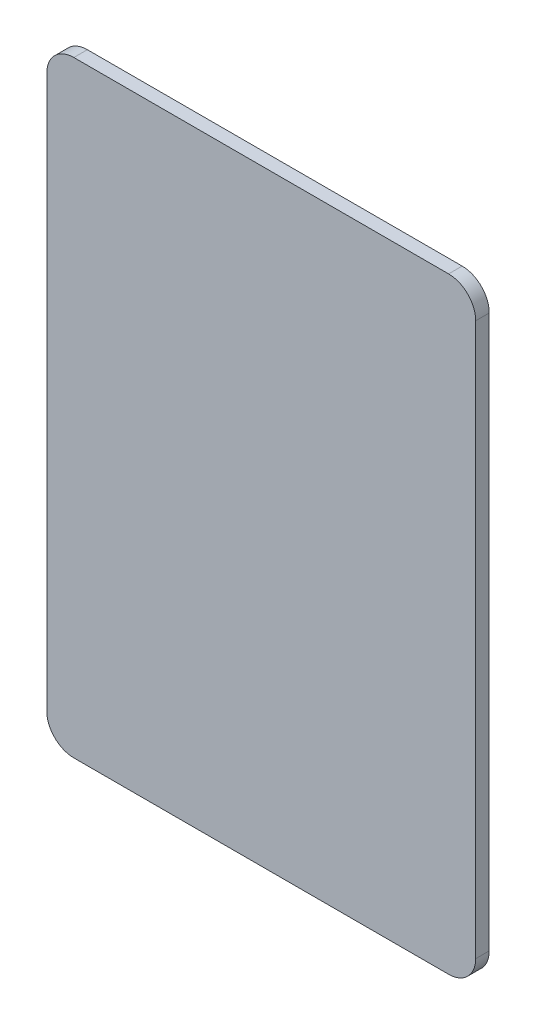
ISO-10303-21;
HEADER;
FILE_DESCRIPTION(('STEP AP214'),'2;1');
FILE_NAME('part.step','',(''),(''),'','','');
FILE_SCHEMA(('AUTOMOTIVE_DESIGN { 1 0 10303 214 1 1 1 1 }'));
ENDSEC;
DATA;
#1=APPLICATION_CONTEXT('core data for automotive mechanical design processes');
#2=APPLICATION_PROTOCOL_DEFINITION('international standard','automotive_design',2000,#1);
#3=PRODUCT_CONTEXT('',#1,'mechanical');
#4=PRODUCT('Part','Part','',(#3));
#5=PRODUCT_RELATED_PRODUCT_CATEGORY('part','',(#4));
#6=PRODUCT_DEFINITION_FORMATION('','',#4);
#7=PRODUCT_DEFINITION_CONTEXT('part definition',#1,'design');
#8=PRODUCT_DEFINITION('design','',#6,#7);
#9=PRODUCT_DEFINITION_SHAPE('','',#8);
#10=(LENGTH_UNIT() NAMED_UNIT(*) SI_UNIT(.MILLI.,.METRE.));
#11=(NAMED_UNIT(*) PLANE_ANGLE_UNIT() SI_UNIT($,.RADIAN.));
#12=(NAMED_UNIT(*) SI_UNIT($,.STERADIAN.) SOLID_ANGLE_UNIT());
#13=UNCERTAINTY_MEASURE_WITH_UNIT(LENGTH_MEASURE(1.E-05),#10,'distance_accuracy_value','');
#14=(GEOMETRIC_REPRESENTATION_CONTEXT(3) GLOBAL_UNCERTAINTY_ASSIGNED_CONTEXT((#13)) GLOBAL_UNIT_ASSIGNED_CONTEXT((#10,
#11,#12)) REPRESENTATION_CONTEXT('',''));
#15=CARTESIAN_POINT('',(0.,0.,0.));
#16=DIRECTION('',(0.,0.,1.));
#17=DIRECTION('',(1.,0.,0.));
#18=AXIS2_PLACEMENT_3D('',#15,#16,#17);
#19=CARTESIAN_POINT('',(0.,0.,1.5875));
#20=DIRECTION('',(1.,0.,0.));
#21=DIRECTION('',(0.,0.,-1.));
#22=AXIS2_PLACEMENT_3D('',#19,#20,#21);
#23=PLANE('',#22);
#24=DIRECTION('',(0.,-1.,0.));
#25=VECTOR('',#24,1.);
#26=CARTESIAN_POINT('',(0.,0.,0.));
#27=LINE('',#26,#25);
#28=CARTESIAN_POINT('',(0.,67.945,0.));
#29=VERTEX_POINT('',#28);
#30=CARTESIAN_POINT('',(0.,3.175,0.));
#31=VERTEX_POINT('',#30);
#32=EDGE_CURVE('E128',#29,#31,#27,.T.);
#33=ORIENTED_EDGE('',*,*,#32,.T.);
#34=DIRECTION('',(0.,0.,-1.));
#35=VECTOR('',#34,1.);
#36=CARTESIAN_POINT('',(0.,3.175,1.5875));
#37=LINE('',#36,#35);
#38=CARTESIAN_POINT('',(0.,3.175,1.5875));
#39=VERTEX_POINT('',#38);
#40=EDGE_CURVE('E151',#31,#39,#37,.F.);
#41=ORIENTED_EDGE('',*,*,#40,.T.);
#42=DIRECTION('',(0.,-1.,0.));
#43=VECTOR('',#42,1.);
#44=CARTESIAN_POINT('',(0.,0.,1.5875));
#45=LINE('',#44,#43);
#46=CARTESIAN_POINT('',(0.,67.945,1.5875));
#47=VERTEX_POINT('',#46);
#48=EDGE_CURVE('E126',#47,#39,#45,.T.);
#49=ORIENTED_EDGE('',*,*,#48,.F.);
#50=DIRECTION('',(0.,0.,-1.));
#51=VECTOR('',#50,1.);
#52=CARTESIAN_POINT('',(0.,67.945,1.5875));
#53=LINE('',#52,#51);
#54=EDGE_CURVE('E148',#47,#29,#53,.T.);
#55=ORIENTED_EDGE('',*,*,#54,.T.);
#56=EDGE_LOOP('',(#33,#41,#49,#55));
#57=FACE_BOUND('',#56,.T.);
#58=ADVANCED_FACE('F33',(#57),#23,.F.);
#59=CARTESIAN_POINT('',(0.,0.,1.5875));
#60=DIRECTION('',(0.,1.,0.));
#61=DIRECTION('',(0.,0.,1.));
#62=AXIS2_PLACEMENT_3D('',#59,#60,#61);
#63=PLANE('',#62);
#64=DIRECTION('',(1.,0.,0.));
#65=VECTOR('',#64,1.);
#66=CARTESIAN_POINT('',(0.,0.,0.));
#67=LINE('',#66,#65);
#68=CARTESIAN_POINT('',(3.175,0.,0.));
#69=VERTEX_POINT('',#68);
#70=CARTESIAN_POINT('',(47.117,0.,0.));
#71=VERTEX_POINT('',#70);
#72=EDGE_CURVE('E124',#69,#71,#67,.T.);
#73=ORIENTED_EDGE('',*,*,#72,.T.);
#74=DIRECTION('',(0.,0.,-1.));
#75=VECTOR('',#74,1.);
#76=CARTESIAN_POINT('',(47.117,0.,1.5875));
#77=LINE('',#76,#75);
#78=CARTESIAN_POINT('',(47.117,0.,1.5875));
#79=VERTEX_POINT('',#78);
#80=EDGE_CURVE('E103',#71,#79,#77,.F.);
#81=ORIENTED_EDGE('',*,*,#80,.T.);
#82=DIRECTION('',(1.,0.,0.));
#83=VECTOR('',#82,1.);
#84=CARTESIAN_POINT('',(0.,0.,1.5875));
#85=LINE('',#84,#83);
#86=CARTESIAN_POINT('',(3.175,0.,1.5875));
#87=VERTEX_POINT('',#86);
#88=EDGE_CURVE('E167',#87,#79,#85,.T.);
#89=ORIENTED_EDGE('',*,*,#88,.F.);
#90=DIRECTION('',(0.,0.,-1.));
#91=VECTOR('',#90,1.);
#92=CARTESIAN_POINT('',(3.175,0.,1.5875));
#93=LINE('',#92,#91);
#94=EDGE_CURVE('E108',#87,#69,#93,.T.);
#95=ORIENTED_EDGE('',*,*,#94,.T.);
#96=EDGE_LOOP('',(#73,#81,#89,#95));
#97=FACE_BOUND('',#96,.T.);
#98=ADVANCED_FACE('F184',(#97),#63,.F.);
#99=CARTESIAN_POINT('',(50.292,0.,1.5875));
#100=DIRECTION('',(-1.,0.,0.));
#101=DIRECTION('',(0.,0.,1.));
#102=AXIS2_PLACEMENT_3D('',#99,#100,#101);
#103=PLANE('',#102);
#104=DIRECTION('',(0.,1.,0.));
#105=VECTOR('',#104,1.);
#106=CARTESIAN_POINT('',(50.292,0.,1.5875));
#107=LINE('',#106,#105);
#108=CARTESIAN_POINT('',(50.292,3.175,1.5875));
#109=VERTEX_POINT('',#108);
#110=CARTESIAN_POINT('',(50.292,67.945,1.5875));
#111=VERTEX_POINT('',#110);
#112=EDGE_CURVE('E117',#109,#111,#107,.T.);
#113=ORIENTED_EDGE('',*,*,#112,.F.);
#114=DIRECTION('',(0.,0.,-1.));
#115=VECTOR('',#114,1.);
#116=CARTESIAN_POINT('',(50.292,3.175,1.5875));
#117=LINE('',#116,#115);
#118=CARTESIAN_POINT('',(50.292,3.175,0.));
#119=VERTEX_POINT('',#118);
#120=EDGE_CURVE('E102',#109,#119,#117,.T.);
#121=ORIENTED_EDGE('',*,*,#120,.T.);
#122=DIRECTION('',(0.,1.,0.));
#123=VECTOR('',#122,1.);
#124=CARTESIAN_POINT('',(50.292,0.,0.));
#125=LINE('',#124,#123);
#126=CARTESIAN_POINT('',(50.292,67.945,0.));
#127=VERTEX_POINT('',#126);
#128=EDGE_CURVE('E115',#119,#127,#125,.T.);
#129=ORIENTED_EDGE('',*,*,#128,.T.);
#130=DIRECTION('',(0.,0.,-1.));
#131=VECTOR('',#130,1.);
#132=CARTESIAN_POINT('',(50.292,67.945,1.5875));
#133=LINE('',#132,#131);
#134=EDGE_CURVE('E119',#127,#111,#133,.F.);
#135=ORIENTED_EDGE('',*,*,#134,.T.);
#136=EDGE_LOOP('',(#113,#121,#129,#135));
#137=FACE_BOUND('',#136,.T.);
#138=ADVANCED_FACE('F114',(#137),#103,.F.);
#139=CARTESIAN_POINT('',(0.,71.12,1.5875));
#140=DIRECTION('',(0.,-1.,0.));
#141=DIRECTION('',(0.,0.,-1.));
#142=AXIS2_PLACEMENT_3D('',#139,#140,#141);
#143=PLANE('',#142);
#144=DIRECTION('',(-1.,0.,0.));
#145=VECTOR('',#144,1.);
#146=CARTESIAN_POINT('',(0.,71.12,0.));
#147=LINE('',#146,#145);
#148=CARTESIAN_POINT('',(47.117,71.12,0.));
#149=VERTEX_POINT('',#148);
#150=CARTESIAN_POINT('',(3.175,71.12,0.));
#151=VERTEX_POINT('',#150);
#152=EDGE_CURVE('E123',#149,#151,#147,.T.);
#153=ORIENTED_EDGE('',*,*,#152,.T.);
#154=DIRECTION('',(0.,0.,-1.));
#155=VECTOR('',#154,1.);
#156=CARTESIAN_POINT('',(3.175,71.12,1.5875));
#157=LINE('',#156,#155);
#158=CARTESIAN_POINT('',(3.175,71.12,1.5875));
#159=VERTEX_POINT('',#158);
#160=EDGE_CURVE('E11',#151,#159,#157,.F.);
#161=ORIENTED_EDGE('',*,*,#160,.T.);
#162=DIRECTION('',(-1.,0.,0.));
#163=VECTOR('',#162,1.);
#164=CARTESIAN_POINT('',(0.,71.12,1.5875));
#165=LINE('',#164,#163);
#166=CARTESIAN_POINT('',(47.117,71.12,1.5875));
#167=VERTEX_POINT('',#166);
#168=EDGE_CURVE('E132',#167,#159,#165,.T.);
#169=ORIENTED_EDGE('',*,*,#168,.F.);
#170=DIRECTION('',(0.,0.,-1.));
#171=VECTOR('',#170,1.);
#172=CARTESIAN_POINT('',(47.117,71.12,1.5875));
#173=LINE('',#172,#171);
#174=EDGE_CURVE('E41',#167,#149,#173,.T.);
#175=ORIENTED_EDGE('',*,*,#174,.T.);
#176=EDGE_LOOP('',(#153,#161,#169,#175));
#177=FACE_BOUND('',#176,.T.);
#178=ADVANCED_FACE('F154',(#177),#143,.F.);
#179=CARTESIAN_POINT('',(0.,0.,1.5875));
#180=DIRECTION('',(0.,0.,-1.));
#181=DIRECTION('',(-1.,0.,0.));
#182=AXIS2_PLACEMENT_3D('',#179,#180,#181);
#183=PLANE('',#182);
#184=ORIENTED_EDGE('',*,*,#88,.T.);
#185=CARTESIAN_POINT('',(47.117,3.175,1.5875));
#186=DIRECTION('',(0.,0.,-1.));
#187=DIRECTION('',(-1.,0.,0.));
#188=AXIS2_PLACEMENT_3D('',#185,#186,#187);
#189=CIRCLE('',#188,3.175);
#190=EDGE_CURVE('E146',#79,#109,#189,.F.);
#191=ORIENTED_EDGE('',*,*,#190,.T.);
#192=ORIENTED_EDGE('',*,*,#112,.T.);
#193=CARTESIAN_POINT('',(47.117,67.945,1.5875));
#194=DIRECTION('',(0.,0.,-1.));
#195=DIRECTION('',(-1.,0.,0.));
#196=AXIS2_PLACEMENT_3D('',#193,#194,#195);
#197=CIRCLE('',#196,3.175);
#198=EDGE_CURVE('E53',#111,#167,#197,.F.);
#199=ORIENTED_EDGE('',*,*,#198,.T.);
#200=ORIENTED_EDGE('',*,*,#168,.T.);
#201=CARTESIAN_POINT('',(3.175,67.945,1.5875));
#202=DIRECTION('',(0.,0.,-1.));
#203=DIRECTION('',(-1.,0.,0.));
#204=AXIS2_PLACEMENT_3D('',#201,#202,#203);
#205=CIRCLE('',#204,3.175);
#206=EDGE_CURVE('E142',#159,#47,#205,.F.);
#207=ORIENTED_EDGE('',*,*,#206,.T.);
#208=ORIENTED_EDGE('',*,*,#48,.T.);
#209=CARTESIAN_POINT('',(3.175,3.175,1.5875));
#210=DIRECTION('',(0.,0.,-1.));
#211=DIRECTION('',(-1.,0.,0.));
#212=AXIS2_PLACEMENT_3D('',#209,#210,#211);
#213=CIRCLE('',#212,3.175);
#214=EDGE_CURVE('E144',#39,#87,#213,.F.);
#215=ORIENTED_EDGE('',*,*,#214,.T.);
#216=EDGE_LOOP('',(#184,#191,#192,#199,#200,#207,#208,#215));
#217=FACE_BOUND('',#216,.T.);
#218=ADVANCED_FACE('F173',(#217),#183,.F.);
#219=CARTESIAN_POINT('',(0.,0.,0.));
#220=DIRECTION('',(0.,0.,-1.));
#221=DIRECTION('',(-1.,0.,0.));
#222=AXIS2_PLACEMENT_3D('',#219,#220,#221);
#223=PLANE('',#222);
#224=ORIENTED_EDGE('',*,*,#128,.F.);
#225=CARTESIAN_POINT('',(47.117,3.175,0.));
#226=DIRECTION('',(0.,0.,-1.));
#227=DIRECTION('',(-1.,0.,0.));
#228=AXIS2_PLACEMENT_3D('',#225,#226,#227);
#229=CIRCLE('',#228,3.175);
#230=EDGE_CURVE('E98',#119,#71,#229,.T.);
#231=ORIENTED_EDGE('',*,*,#230,.T.);
#232=ORIENTED_EDGE('',*,*,#72,.F.);
#233=CARTESIAN_POINT('',(3.175,3.175,0.));
#234=DIRECTION('',(0.,0.,-1.));
#235=DIRECTION('',(-1.,0.,0.));
#236=AXIS2_PLACEMENT_3D('',#233,#234,#235);
#237=CIRCLE('',#236,3.175);
#238=EDGE_CURVE('E109',#69,#31,#237,.T.);
#239=ORIENTED_EDGE('',*,*,#238,.T.);
#240=ORIENTED_EDGE('',*,*,#32,.F.);
#241=CARTESIAN_POINT('',(3.175,67.945,0.));
#242=DIRECTION('',(0.,0.,-1.));
#243=DIRECTION('',(-1.,0.,0.));
#244=AXIS2_PLACEMENT_3D('',#241,#242,#243);
#245=CIRCLE('',#244,3.175);
#246=EDGE_CURVE('E135',#29,#151,#245,.T.);
#247=ORIENTED_EDGE('',*,*,#246,.T.);
#248=ORIENTED_EDGE('',*,*,#152,.F.);
#249=CARTESIAN_POINT('',(47.117,67.945,0.));
#250=DIRECTION('',(0.,0.,-1.));
#251=DIRECTION('',(-1.,0.,0.));
#252=AXIS2_PLACEMENT_3D('',#249,#250,#251);
#253=CIRCLE('',#252,3.175);
#254=EDGE_CURVE('E118',#149,#127,#253,.T.);
#255=ORIENTED_EDGE('',*,*,#254,.T.);
#256=EDGE_LOOP('',(#224,#231,#232,#239,#240,#247,#248,#255));
#257=FACE_BOUND('',#256,.T.);
#258=ADVANCED_FACE('F121',(#257),#223,.T.);
#259=CARTESIAN_POINT('',(47.117,3.175,1.5875));
#260=DIRECTION('',(0.,0.,-1.));
#261=DIRECTION('',(-1.,0.,0.));
#262=AXIS2_PLACEMENT_3D('',#259,#260,#261);
#263=CYLINDRICAL_SURFACE('',#262,3.175);
#264=ORIENTED_EDGE('',*,*,#190,.F.);
#265=ORIENTED_EDGE('',*,*,#80,.F.);
#266=ORIENTED_EDGE('',*,*,#230,.F.);
#267=ORIENTED_EDGE('',*,*,#120,.F.);
#268=EDGE_LOOP('',(#264,#265,#266,#267));
#269=FACE_BOUND('',#268,.T.);
#270=ADVANCED_FACE('F101',(#269),#263,.T.);
#271=CARTESIAN_POINT('',(3.175,3.175,1.5875));
#272=DIRECTION('',(0.,0.,-1.));
#273=DIRECTION('',(-1.,0.,0.));
#274=AXIS2_PLACEMENT_3D('',#271,#272,#273);
#275=CYLINDRICAL_SURFACE('',#274,3.175);
#276=ORIENTED_EDGE('',*,*,#214,.F.);
#277=ORIENTED_EDGE('',*,*,#40,.F.);
#278=ORIENTED_EDGE('',*,*,#238,.F.);
#279=ORIENTED_EDGE('',*,*,#94,.F.);
#280=EDGE_LOOP('',(#276,#277,#278,#279));
#281=FACE_BOUND('',#280,.T.);
#282=ADVANCED_FACE('F195',(#281),#275,.T.);
#283=CARTESIAN_POINT('',(3.175,67.945,1.5875));
#284=DIRECTION('',(0.,0.,-1.));
#285=DIRECTION('',(-1.,0.,0.));
#286=AXIS2_PLACEMENT_3D('',#283,#284,#285);
#287=CYLINDRICAL_SURFACE('',#286,3.175);
#288=ORIENTED_EDGE('',*,*,#206,.F.);
#289=ORIENTED_EDGE('',*,*,#160,.F.);
#290=ORIENTED_EDGE('',*,*,#246,.F.);
#291=ORIENTED_EDGE('',*,*,#54,.F.);
#292=EDGE_LOOP('',(#288,#289,#290,#291));
#293=FACE_BOUND('',#292,.T.);
#294=ADVANCED_FACE('F161',(#293),#287,.T.);
#295=CARTESIAN_POINT('',(47.117,67.945,1.5875));
#296=DIRECTION('',(0.,0.,-1.));
#297=DIRECTION('',(-1.,0.,0.));
#298=AXIS2_PLACEMENT_3D('',#295,#296,#297);
#299=CYLINDRICAL_SURFACE('',#298,3.175);
#300=ORIENTED_EDGE('',*,*,#198,.F.);
#301=ORIENTED_EDGE('',*,*,#134,.F.);
#302=ORIENTED_EDGE('',*,*,#254,.F.);
#303=ORIENTED_EDGE('',*,*,#174,.F.);
#304=EDGE_LOOP('',(#300,#301,#302,#303));
#305=FACE_BOUND('',#304,.T.);
#306=ADVANCED_FACE('F35',(#305),#299,.T.);
#307=CLOSED_SHELL('',(#58,#98,#138,#178,#218,#258,#270,#282,#294,#306));
#308=MANIFOLD_SOLID_BREP('B2',#307);
#309=ADVANCED_BREP_SHAPE_REPRESENTATION('',(#18,#308),#14);
#310=SHAPE_DEFINITION_REPRESENTATION(#9,#309);
ENDSEC;
END-ISO-10303-21;
